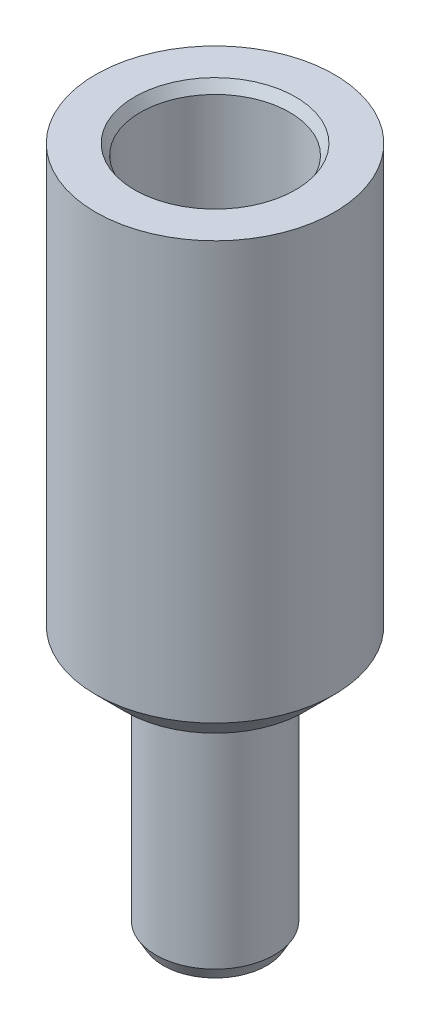
ISO-10303-21;
HEADER;
FILE_DESCRIPTION(('STEP AP214'),'2;1');
FILE_NAME('part.step','',(''),(''),'','','');
FILE_SCHEMA(('AUTOMOTIVE_DESIGN { 1 0 10303 214 1 1 1 1 }'));
ENDSEC;
DATA;
#1=APPLICATION_CONTEXT('core data for automotive mechanical design processes');
#2=APPLICATION_PROTOCOL_DEFINITION('international standard','automotive_design',2000,#1);
#3=PRODUCT_CONTEXT('',#1,'mechanical');
#4=PRODUCT('Part','Part','',(#3));
#5=PRODUCT_RELATED_PRODUCT_CATEGORY('part','',(#4));
#6=PRODUCT_DEFINITION_FORMATION('','',#4);
#7=PRODUCT_DEFINITION_CONTEXT('part definition',#1,'design');
#8=PRODUCT_DEFINITION('design','',#6,#7);
#9=PRODUCT_DEFINITION_SHAPE('','',#8);
#10=(LENGTH_UNIT() NAMED_UNIT(*) SI_UNIT(.MILLI.,.METRE.));
#11=(NAMED_UNIT(*) PLANE_ANGLE_UNIT() SI_UNIT($,.RADIAN.));
#12=(NAMED_UNIT(*) SI_UNIT($,.STERADIAN.) SOLID_ANGLE_UNIT());
#13=UNCERTAINTY_MEASURE_WITH_UNIT(LENGTH_MEASURE(1.E-05),#10,'distance_accuracy_value','');
#14=(GEOMETRIC_REPRESENTATION_CONTEXT(3) GLOBAL_UNCERTAINTY_ASSIGNED_CONTEXT((#13)) GLOBAL_UNIT_ASSIGNED_CONTEXT((#10,
#11,#12)) REPRESENTATION_CONTEXT('',''));
#15=CARTESIAN_POINT('',(0.,0.,0.));
#16=DIRECTION('',(0.,0.,1.));
#17=DIRECTION('',(1.,0.,0.));
#18=AXIS2_PLACEMENT_3D('',#15,#16,#17);
#19=CARTESIAN_POINT('',(0.,23.,0.));
#20=DIRECTION('',(0.,1.,0.));
#21=DIRECTION('',(0.,0.,1.));
#22=AXIS2_PLACEMENT_3D('',#19,#20,#21);
#23=CYLINDRICAL_SURFACE('',#22,1.25);
#24=CARTESIAN_POINT('',(0.,0.,0.));
#25=DIRECTION('',(0.,1.,0.));
#26=DIRECTION('',(0.,0.,1.));
#27=AXIS2_PLACEMENT_3D('',#24,#25,#26);
#28=CIRCLE('',#27,1.25);
#29=CARTESIAN_POINT('',(0.,0.,1.25));
#30=VERTEX_POINT('',#29);
#31=EDGE_CURVE('E39',#30,#30,#28,.T.);
#32=ORIENTED_EDGE('',*,*,#31,.F.);
#33=EDGE_LOOP('',(#32));
#34=FACE_BOUND('',#33,.T.);
#35=CARTESIAN_POINT('',(0.,10.,0.));
#36=DIRECTION('',(0.,1.,0.));
#37=DIRECTION('',(0.,0.,1.));
#38=AXIS2_PLACEMENT_3D('',#35,#36,#37);
#39=CIRCLE('',#38,1.25);
#40=CARTESIAN_POINT('',(0.,10.,1.25));
#41=VERTEX_POINT('',#40);
#42=EDGE_CURVE('E36',#41,#41,#39,.F.);
#43=ORIENTED_EDGE('',*,*,#42,.F.);
#44=EDGE_LOOP('',(#43));
#45=FACE_BOUND('',#44,.T.);
#46=ADVANCED_FACE('F15',(#34,#45),#23,.F.);
#47=CARTESIAN_POINT('',(0.,8.,0.));
#48=DIRECTION('',(0.,-1.,0.));
#49=DIRECTION('',(0.,0.,-1.));
#50=AXIS2_PLACEMENT_3D('',#47,#48,#49);
#51=CYLINDRICAL_SURFACE('',#50,1.985);
#52=CARTESIAN_POINT('',(0.,0.433012701892211,0.));
#53=DIRECTION('',(0.,1.,0.));
#54=DIRECTION('',(0.,0.,1.));
#55=AXIS2_PLACEMENT_3D('',#52,#53,#54);
#56=CIRCLE('',#55,1.985);
#57=CARTESIAN_POINT('',(0.,0.433012701892211,1.985));
#58=VERTEX_POINT('',#57);
#59=EDGE_CURVE('E43',#58,#58,#56,.T.);
#60=ORIENTED_EDGE('',*,*,#59,.T.);
#61=EDGE_LOOP('',(#60));
#62=FACE_BOUND('',#61,.T.);
#63=CARTESIAN_POINT('',(0.,8.,0.));
#64=DIRECTION('',(0.,1.,0.));
#65=DIRECTION('',(0.,0.,1.));
#66=AXIS2_PLACEMENT_3D('',#63,#64,#65);
#67=CIRCLE('',#66,1.985);
#68=CARTESIAN_POINT('',(0.,8.,1.985));
#69=VERTEX_POINT('',#68);
#70=EDGE_CURVE('E46',#69,#69,#67,.T.);
#71=ORIENTED_EDGE('',*,*,#70,.F.);
#72=EDGE_LOOP('',(#71));
#73=FACE_BOUND('',#72,.T.);
#74=ADVANCED_FACE('F74',(#62,#73),#51,.T.);
#75=CARTESIAN_POINT('',(0.,0.,0.));
#76=DIRECTION('',(0.,1.,0.));
#77=DIRECTION('',(0.,0.,1.));
#78=AXIS2_PLACEMENT_3D('',#75,#76,#77);
#79=PLANE('',#78);
#80=CARTESIAN_POINT('',(0.,0.,0.));
#81=DIRECTION('',(0.,1.,0.));
#82=DIRECTION('',(0.,0.,1.));
#83=AXIS2_PLACEMENT_3D('',#80,#81,#82);
#84=CIRCLE('',#83,1.735);
#85=CARTESIAN_POINT('',(0.,0.,1.735));
#86=VERTEX_POINT('',#85);
#87=EDGE_CURVE('E35',#86,#86,#84,.F.);
#88=ORIENTED_EDGE('',*,*,#87,.T.);
#89=EDGE_LOOP('',(#88));
#90=FACE_BOUND('',#89,.T.);
#91=ORIENTED_EDGE('',*,*,#31,.T.);
#92=EDGE_LOOP('',(#91));
#93=FACE_BOUND('',#92,.T.);
#94=ADVANCED_FACE('F79',(#90,#93),#79,.F.);
#95=CARTESIAN_POINT('',(0.,23.,0.));
#96=DIRECTION('',(0.,-1.,0.));
#97=DIRECTION('',(0.,0.,-1.));
#98=AXIS2_PLACEMENT_3D('',#95,#96,#97);
#99=CYLINDRICAL_SURFACE('',#98,4.);
#100=CARTESIAN_POINT('',(0.,9.,0.));
#101=DIRECTION('',(0.,1.,0.));
#102=DIRECTION('',(0.,0.,1.));
#103=AXIS2_PLACEMENT_3D('',#100,#101,#102);
#104=CIRCLE('',#103,4.);
#105=CARTESIAN_POINT('',(0.,9.,4.));
#106=VERTEX_POINT('',#105);
#107=EDGE_CURVE('E30',#106,#106,#104,.T.);
#108=ORIENTED_EDGE('',*,*,#107,.T.);
#109=EDGE_LOOP('',(#108));
#110=FACE_BOUND('',#109,.T.);
#111=CARTESIAN_POINT('',(0.,23.,0.));
#112=DIRECTION('',(0.,1.,0.));
#113=DIRECTION('',(0.,0.,1.));
#114=AXIS2_PLACEMENT_3D('',#111,#112,#113);
#115=CIRCLE('',#114,4.);
#116=CARTESIAN_POINT('',(0.,23.,4.));
#117=VERTEX_POINT('',#116);
#118=EDGE_CURVE('E49',#117,#117,#115,.T.);
#119=ORIENTED_EDGE('',*,*,#118,.F.);
#120=EDGE_LOOP('',(#119));
#121=FACE_BOUND('',#120,.T.);
#122=ADVANCED_FACE('F89',(#110,#121),#99,.T.);
#123=CARTESIAN_POINT('',(0.,23.,0.));
#124=DIRECTION('',(0.,1.,0.));
#125=DIRECTION('',(0.,0.,1.));
#126=AXIS2_PLACEMENT_3D('',#123,#124,#125);
#127=PLANE('',#126);
#128=CARTESIAN_POINT('',(0.,23.,0.));
#129=DIRECTION('',(0.,1.,0.));
#130=DIRECTION('',(0.,0.,1.));
#131=AXIS2_PLACEMENT_3D('',#128,#129,#130);
#132=CIRCLE('',#131,2.70000000000003);
#133=CARTESIAN_POINT('',(0.,23.,2.70000000000003));
#134=VERTEX_POINT('',#133);
#135=EDGE_CURVE('E10',#134,#134,#132,.F.);
#136=ORIENTED_EDGE('',*,*,#135,.T.);
#137=EDGE_LOOP('',(#136));
#138=FACE_BOUND('',#137,.T.);
#139=ORIENTED_EDGE('',*,*,#118,.T.);
#140=EDGE_LOOP('',(#139));
#141=FACE_BOUND('',#140,.T.);
#142=ADVANCED_FACE('F85',(#138,#141),#127,.T.);
#143=CARTESIAN_POINT('',(0.,8.,0.));
#144=DIRECTION('',(0.,1.,0.));
#145=DIRECTION('',(0.,0.,1.));
#146=AXIS2_PLACEMENT_3D('',#143,#144,#145);
#147=PLANE('',#146);
#148=CARTESIAN_POINT('',(0.,8.,0.));
#149=DIRECTION('',(0.,1.,0.));
#150=DIRECTION('',(0.,0.,1.));
#151=AXIS2_PLACEMENT_3D('',#148,#149,#150);
#152=CIRCLE('',#151,3.);
#153=CARTESIAN_POINT('',(0.,8.,3.));
#154=VERTEX_POINT('',#153);
#155=EDGE_CURVE('E26',#154,#154,#152,.F.);
#156=ORIENTED_EDGE('',*,*,#155,.T.);
#157=EDGE_LOOP('',(#156));
#158=FACE_BOUND('',#157,.T.);
#159=ORIENTED_EDGE('',*,*,#70,.T.);
#160=EDGE_LOOP('',(#159));
#161=FACE_BOUND('',#160,.T.);
#162=ADVANCED_FACE('F88',(#158,#161),#147,.F.);
#163=CARTESIAN_POINT('',(0.,0.433012701892211,0.));
#164=DIRECTION('',(0.,1.,0.));
#165=DIRECTION('',(0.,0.,1.));
#166=AXIS2_PLACEMENT_3D('',#163,#164,#165);
#167=CONICAL_SURFACE('',#166,1.985,0.523598775598301);
#168=ORIENTED_EDGE('',*,*,#87,.F.);
#169=EDGE_LOOP('',(#168));
#170=FACE_BOUND('',#169,.T.);
#171=ORIENTED_EDGE('',*,*,#59,.F.);
#172=EDGE_LOOP('',(#171));
#173=FACE_BOUND('',#172,.T.);
#174=ADVANCED_FACE('F70',(#170,#173),#167,.T.);
#175=CARTESIAN_POINT('',(0.,10.,0.));
#176=DIRECTION('',(0.,1.,0.));
#177=DIRECTION('',(0.,0.,1.));
#178=AXIS2_PLACEMENT_3D('',#175,#176,#177);
#179=PLANE('',#178);
#180=CARTESIAN_POINT('',(0.,10.,0.));
#181=DIRECTION('',(0.,1.,0.));
#182=DIRECTION('',(0.,0.,1.));
#183=AXIS2_PLACEMENT_3D('',#180,#181,#182);
#184=CIRCLE('',#183,2.5);
#185=CARTESIAN_POINT('',(0.,10.,2.5));
#186=VERTEX_POINT('',#185);
#187=EDGE_CURVE('E40',#186,#186,#184,.T.);
#188=ORIENTED_EDGE('',*,*,#187,.T.);
#189=EDGE_LOOP('',(#188));
#190=FACE_BOUND('',#189,.T.);
#191=ORIENTED_EDGE('',*,*,#42,.T.);
#192=EDGE_LOOP('',(#191));
#193=FACE_BOUND('',#192,.T.);
#194=ADVANCED_FACE('F57',(#190,#193),#179,.T.);
#195=CARTESIAN_POINT('',(0.,10.,0.));
#196=DIRECTION('',(0.,1.,0.));
#197=DIRECTION('',(0.,0.,1.));
#198=AXIS2_PLACEMENT_3D('',#195,#196,#197);
#199=CYLINDRICAL_SURFACE('',#198,2.5);
#200=CARTESIAN_POINT('',(0.,22.6535898384862,0.));
#201=DIRECTION('',(0.,1.,0.));
#202=DIRECTION('',(0.,0.,1.));
#203=AXIS2_PLACEMENT_3D('',#200,#201,#202);
#204=CIRCLE('',#203,2.5);
#205=CARTESIAN_POINT('',(0.,22.6535898384862,2.5));
#206=VERTEX_POINT('',#205);
#207=EDGE_CURVE('E22',#206,#206,#204,.T.);
#208=ORIENTED_EDGE('',*,*,#207,.T.);
#209=EDGE_LOOP('',(#208));
#210=FACE_BOUND('',#209,.T.);
#211=ORIENTED_EDGE('',*,*,#187,.F.);
#212=EDGE_LOOP('',(#211));
#213=FACE_BOUND('',#212,.T.);
#214=ADVANCED_FACE('F60',(#210,#213),#199,.F.);
#215=CARTESIAN_POINT('',(0.,9.,0.));
#216=DIRECTION('',(0.,1.,0.));
#217=DIRECTION('',(0.,0.,1.));
#218=AXIS2_PLACEMENT_3D('',#215,#216,#217);
#219=CONICAL_SURFACE('',#218,4.,0.78539816339745);
#220=ORIENTED_EDGE('',*,*,#155,.F.);
#221=EDGE_LOOP('',(#220));
#222=FACE_BOUND('',#221,.T.);
#223=ORIENTED_EDGE('',*,*,#107,.F.);
#224=EDGE_LOOP('',(#223));
#225=FACE_BOUND('',#224,.T.);
#226=ADVANCED_FACE('F62',(#222,#225),#219,.T.);
#227=CARTESIAN_POINT('',(0.,22.6535898384862,0.));
#228=DIRECTION('',(0.,1.,0.));
#229=DIRECTION('',(0.,0.,1.));
#230=AXIS2_PLACEMENT_3D('',#227,#228,#229);
#231=CONICAL_SURFACE('',#230,2.5,0.523598775598297);
#232=ORIENTED_EDGE('',*,*,#135,.F.);
#233=EDGE_LOOP('',(#232));
#234=FACE_BOUND('',#233,.T.);
#235=ORIENTED_EDGE('',*,*,#207,.F.);
#236=EDGE_LOOP('',(#235));
#237=FACE_BOUND('',#236,.T.);
#238=ADVANCED_FACE('F17',(#234,#237),#231,.F.);
#239=CLOSED_SHELL('',(#46,#74,#94,#122,#142,#162,#174,#194,#214,#226,#238));
#240=MANIFOLD_SOLID_BREP('B1',#239);
#241=ADVANCED_BREP_SHAPE_REPRESENTATION('',(#18,#240),#14);
#242=SHAPE_DEFINITION_REPRESENTATION(#9,#241);
ENDSEC;
END-ISO-10303-21;
